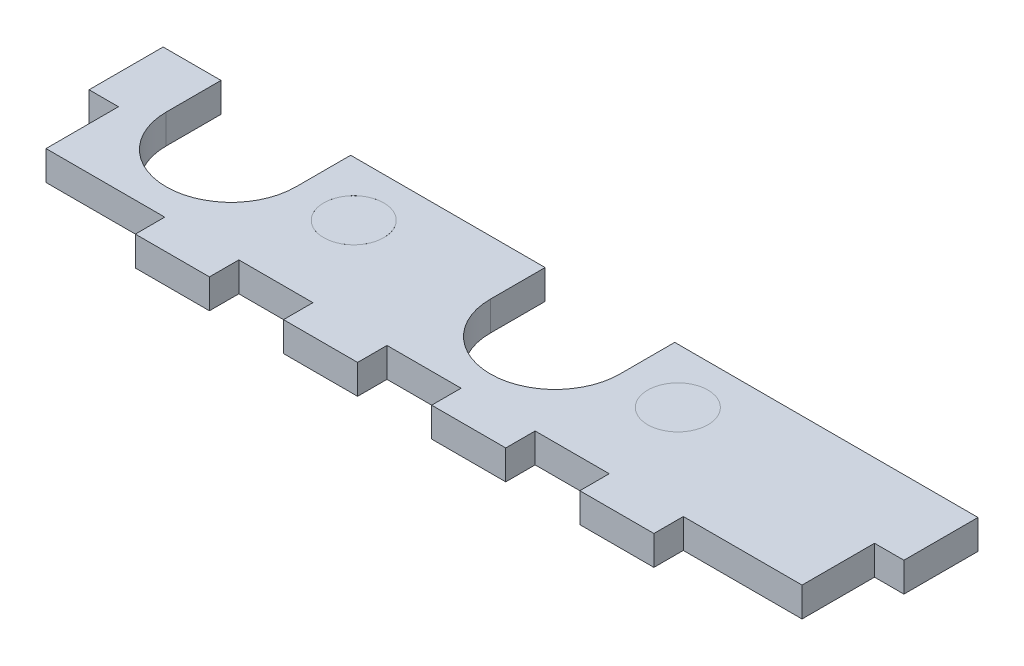
ISO-10303-21;
HEADER;
FILE_DESCRIPTION(('STEP AP214'),'2;1');
FILE_NAME('part.step','',(''),(''),'','','');
FILE_SCHEMA(('AUTOMOTIVE_DESIGN { 1 0 10303 214 1 1 1 1 }'));
ENDSEC;
DATA;
#1=APPLICATION_CONTEXT('core data for automotive mechanical design processes');
#2=APPLICATION_PROTOCOL_DEFINITION('international standard','automotive_design',2000,#1);
#3=PRODUCT_CONTEXT('',#1,'mechanical');
#4=PRODUCT('Part','Part','',(#3));
#5=PRODUCT_RELATED_PRODUCT_CATEGORY('part','',(#4));
#6=PRODUCT_DEFINITION_FORMATION('','',#4);
#7=PRODUCT_DEFINITION_CONTEXT('part definition',#1,'design');
#8=PRODUCT_DEFINITION('design','',#6,#7);
#9=PRODUCT_DEFINITION_SHAPE('','',#8);
#10=(LENGTH_UNIT() NAMED_UNIT(*) SI_UNIT(.MILLI.,.METRE.));
#11=(NAMED_UNIT(*) PLANE_ANGLE_UNIT() SI_UNIT($,.RADIAN.));
#12=(NAMED_UNIT(*) SI_UNIT($,.STERADIAN.) SOLID_ANGLE_UNIT());
#13=UNCERTAINTY_MEASURE_WITH_UNIT(LENGTH_MEASURE(1.E-05),#10,'distance_accuracy_value','');
#14=(GEOMETRIC_REPRESENTATION_CONTEXT(3) GLOBAL_UNCERTAINTY_ASSIGNED_CONTEXT((#13)) GLOBAL_UNIT_ASSIGNED_CONTEXT((#10,
#11,#12)) REPRESENTATION_CONTEXT('',''));
#15=CARTESIAN_POINT('',(0.,0.,0.));
#16=DIRECTION('',(0.,0.,1.));
#17=DIRECTION('',(1.,0.,0.));
#18=AXIS2_PLACEMENT_3D('',#15,#16,#17);
#19=CARTESIAN_POINT('',(61.5,0.,16.915));
#20=DIRECTION('',(0.,1.,0.));
#21=DIRECTION('',(0.,0.,1.));
#22=AXIS2_PLACEMENT_3D('',#19,#20,#21);
#23=CYLINDRICAL_SURFACE('',#22,3.24999999999999);
#24=CARTESIAN_POINT('',(61.5,0.,16.915));
#25=DIRECTION('',(0.,1.,0.));
#26=DIRECTION('',(0.,0.,1.));
#27=AXIS2_PLACEMENT_3D('',#24,#25,#26);
#28=CIRCLE('',#27,3.24999999999999);
#29=CARTESIAN_POINT('',(61.5,0.,20.165));
#30=VERTEX_POINT('',#29);
#31=EDGE_CURVE('E12',#30,#30,#28,.T.);
#32=ORIENTED_EDGE('',*,*,#31,.T.);
#33=EDGE_LOOP('',(#32));
#34=FACE_BOUND('',#33,.T.);
#35=CARTESIAN_POINT('',(61.5,3.175,16.915));
#36=DIRECTION('',(0.,1.,0.));
#37=DIRECTION('',(0.,0.,1.));
#38=AXIS2_PLACEMENT_3D('',#35,#36,#37);
#39=CIRCLE('',#38,3.24999999999999);
#40=CARTESIAN_POINT('',(61.5,3.175,20.165));
#41=VERTEX_POINT('',#40);
#42=EDGE_CURVE('E73',#41,#41,#39,.T.);
#43=ORIENTED_EDGE('',*,*,#42,.F.);
#44=EDGE_LOOP('',(#43));
#45=FACE_BOUND('',#44,.T.);
#46=ADVANCED_FACE('F70',(#34,#45),#23,.T.);
#47=CARTESIAN_POINT('',(61.5,0.,16.915));
#48=DIRECTION('',(0.,1.,0.));
#49=DIRECTION('',(0.,0.,1.));
#50=AXIS2_PLACEMENT_3D('',#47,#48,#49);
#51=PLANE('',#50);
#52=ORIENTED_EDGE('',*,*,#31,.F.);
#53=EDGE_LOOP('',(#52));
#54=FACE_BOUND('',#53,.T.);
#55=ADVANCED_FACE('F85',(#54),#51,.F.);
#56=CARTESIAN_POINT('',(61.5,3.175,16.915));
#57=DIRECTION('',(0.,1.,0.));
#58=DIRECTION('',(0.,0.,1.));
#59=AXIS2_PLACEMENT_3D('',#56,#57,#58);
#60=PLANE('',#59);
#61=ORIENTED_EDGE('',*,*,#42,.T.);
#62=EDGE_LOOP('',(#61));
#63=FACE_BOUND('',#62,.T.);
#64=ADVANCED_FACE('F82',(#63),#60,.T.);
#65=CLOSED_SHELL('',(#46,#55,#64));
#66=MANIFOLD_SOLID_BREP('B2',#65);
#67=CARTESIAN_POINT('',(26.5,0.,16.915));
#68=DIRECTION('',(0.,1.,0.));
#69=DIRECTION('',(0.,0.,1.));
#70=AXIS2_PLACEMENT_3D('',#67,#68,#69);
#71=CYLINDRICAL_SURFACE('',#70,3.24999999999999);
#72=CARTESIAN_POINT('',(26.5,0.,16.915));
#73=DIRECTION('',(0.,1.,0.));
#74=DIRECTION('',(0.,0.,1.));
#75=AXIS2_PLACEMENT_3D('',#72,#73,#74);
#76=CIRCLE('',#75,3.24999999999999);
#77=CARTESIAN_POINT('',(26.5,0.,20.165));
#78=VERTEX_POINT('',#77);
#79=EDGE_CURVE('E69',#78,#78,#76,.T.);
#80=ORIENTED_EDGE('',*,*,#79,.T.);
#81=EDGE_LOOP('',(#80));
#82=FACE_BOUND('',#81,.T.);
#83=CARTESIAN_POINT('',(26.5,3.175,16.915));
#84=DIRECTION('',(0.,1.,0.));
#85=DIRECTION('',(0.,0.,1.));
#86=AXIS2_PLACEMENT_3D('',#83,#84,#85);
#87=CIRCLE('',#86,3.24999999999999);
#88=CARTESIAN_POINT('',(26.5,3.175,20.165));
#89=VERTEX_POINT('',#88);
#90=EDGE_CURVE('E123',#89,#89,#87,.T.);
#91=ORIENTED_EDGE('',*,*,#90,.F.);
#92=EDGE_LOOP('',(#91));
#93=FACE_BOUND('',#92,.T.);
#94=ADVANCED_FACE('F120',(#82,#93),#71,.T.);
#95=CARTESIAN_POINT('',(26.5,0.,16.915));
#96=DIRECTION('',(0.,1.,0.));
#97=DIRECTION('',(0.,0.,1.));
#98=AXIS2_PLACEMENT_3D('',#95,#96,#97);
#99=PLANE('',#98);
#100=ORIENTED_EDGE('',*,*,#79,.F.);
#101=EDGE_LOOP('',(#100));
#102=FACE_BOUND('',#101,.T.);
#103=ADVANCED_FACE('F135',(#102),#99,.F.);
#104=CARTESIAN_POINT('',(26.5,3.175,16.915));
#105=DIRECTION('',(0.,1.,0.));
#106=DIRECTION('',(0.,0.,1.));
#107=AXIS2_PLACEMENT_3D('',#104,#105,#106);
#108=PLANE('',#107);
#109=ORIENTED_EDGE('',*,*,#90,.T.);
#110=EDGE_LOOP('',(#109));
#111=FACE_BOUND('',#110,.T.);
#112=ADVANCED_FACE('F132',(#111),#108,.T.);
#113=CLOSED_SHELL('',(#94,#103,#112));
#114=MANIFOLD_SOLID_BREP('B7',#113);
#115=CARTESIAN_POINT('',(0.,-0.00100000000000013,11.));
#116=DIRECTION('',(0.,0.,-1.));
#117=DIRECTION('',(-1.,0.,0.));
#118=AXIS2_PLACEMENT_3D('',#115,#116,#117);
#119=PLANE('',#118);
#120=DIRECTION('',(0.,1.,0.));
#121=VECTOR('',#120,1.);
#122=CARTESIAN_POINT('',(41.25,-0.00100000000000013,10.9999999999995));
#123=LINE('',#122,#121);
#124=CARTESIAN_POINT('',(41.25,0.,10.9999999999995));
#125=VERTEX_POINT('',#124);
#126=CARTESIAN_POINT('',(41.25,3.175,10.9999999999995));
#127=VERTEX_POINT('',#126);
#128=EDGE_CURVE('E404',#125,#127,#123,.T.);
#129=ORIENTED_EDGE('',*,*,#128,.F.);
#130=DIRECTION('',(1.,0.,0.));
#131=VECTOR('',#130,1.);
#132=CARTESIAN_POINT('',(0.,0.,11.));
#133=LINE('',#132,#131);
#134=CARTESIAN_POINT('',(20.25,0.,11.));
#135=VERTEX_POINT('',#134);
#136=EDGE_CURVE('E491',#135,#125,#133,.T.);
#137=ORIENTED_EDGE('',*,*,#136,.F.);
#138=DIRECTION('',(0.,1.,0.));
#139=VECTOR('',#138,1.);
#140=CARTESIAN_POINT('',(20.25,-0.00100000000000013,11.));
#141=LINE('',#140,#139);
#142=CARTESIAN_POINT('',(20.25,3.175,11.));
#143=VERTEX_POINT('',#142);
#144=EDGE_CURVE('E425',#135,#143,#141,.T.);
#145=ORIENTED_EDGE('',*,*,#144,.T.);
#146=DIRECTION('',(-1.,0.,0.));
#147=VECTOR('',#146,1.);
#148=CARTESIAN_POINT('',(0.,3.175,11.));
#149=LINE('',#148,#147);
#150=EDGE_CURVE('E186',#127,#143,#149,.T.);
#151=ORIENTED_EDGE('',*,*,#150,.F.);
#152=EDGE_LOOP('',(#129,#137,#145,#151));
#153=FACE_BOUND('',#152,.T.);
#154=ADVANCED_FACE('F161',(#153),#119,.T.);
#155=DIRECTION('',(0.,1.,0.));
#156=VECTOR('',#155,1.);
#157=CARTESIAN_POINT('',(6.25,-0.00100000000000013,11.));
#158=LINE('',#157,#156);
#159=CARTESIAN_POINT('',(6.25,0.,11.));
#160=VERTEX_POINT('',#159);
#161=CARTESIAN_POINT('',(6.25,3.175,11.));
#162=VERTEX_POINT('',#161);
#163=EDGE_CURVE('E423',#160,#162,#158,.T.);
#164=ORIENTED_EDGE('',*,*,#163,.F.);
#165=CARTESIAN_POINT('',(0.,0.,11.));
#166=VERTEX_POINT('',#165);
#167=EDGE_CURVE('E487',#166,#160,#133,.T.);
#168=ORIENTED_EDGE('',*,*,#167,.F.);
#169=DIRECTION('',(0.,1.,0.));
#170=VECTOR('',#169,1.);
#171=CARTESIAN_POINT('',(0.,-0.00100000000000013,11.));
#172=LINE('',#171,#170);
#173=CARTESIAN_POINT('',(0.,3.175,11.));
#174=VERTEX_POINT('',#173);
#175=EDGE_CURVE('E444',#166,#174,#172,.T.);
#176=ORIENTED_EDGE('',*,*,#175,.T.);
#177=EDGE_CURVE('E482',#162,#174,#149,.T.);
#178=ORIENTED_EDGE('',*,*,#177,.F.);
#179=EDGE_LOOP('',(#164,#168,#176,#178));
#180=FACE_BOUND('',#179,.T.);
#181=ADVANCED_FACE('F680',(#180),#119,.T.);
#182=CARTESIAN_POINT('',(0.,3.175,30.));
#183=DIRECTION('',(0.,0.,-1.));
#184=DIRECTION('',(-1.,0.,0.));
#185=AXIS2_PLACEMENT_3D('',#182,#183,#184);
#186=PLANE('',#185);
#187=DIRECTION('',(0.,1.,0.));
#188=VECTOR('',#187,1.);
#189=CARTESIAN_POINT('',(72.,-0.00100000000000013,30.));
#190=LINE('',#189,#188);
#191=CARTESIAN_POINT('',(72.,0.,30.));
#192=VERTEX_POINT('',#191);
#193=CARTESIAN_POINT('',(72.,3.175,30.));
#194=VERTEX_POINT('',#193);
#195=EDGE_CURVE('E450',#192,#194,#190,.T.);
#196=ORIENTED_EDGE('',*,*,#195,.T.);
#197=DIRECTION('',(1.,0.,0.));
#198=VECTOR('',#197,1.);
#199=CARTESIAN_POINT('',(0.,3.175,30.));
#200=LINE('',#199,#198);
#201=CARTESIAN_POINT('',(64.,3.175,30.));
#202=VERTEX_POINT('',#201);
#203=EDGE_CURVE('E605',#202,#194,#200,.T.);
#204=ORIENTED_EDGE('',*,*,#203,.F.);
#205=DIRECTION('',(0.,1.,0.));
#206=VECTOR('',#205,1.);
#207=CARTESIAN_POINT('',(64.,-0.00100000000000013,30.));
#208=LINE('',#207,#206);
#209=CARTESIAN_POINT('',(64.,0.,30.));
#210=VERTEX_POINT('',#209);
#211=EDGE_CURVE('E547',#210,#202,#208,.T.);
#212=ORIENTED_EDGE('',*,*,#211,.F.);
#213=DIRECTION('',(1.,0.,0.));
#214=VECTOR('',#213,1.);
#215=CARTESIAN_POINT('',(0.,0.,30.));
#216=LINE('',#215,#214);
#217=EDGE_CURVE('E609',#210,#192,#216,.T.);
#218=ORIENTED_EDGE('',*,*,#217,.T.);
#219=EDGE_LOOP('',(#196,#204,#212,#218));
#220=FACE_BOUND('',#219,.T.);
#221=ADVANCED_FACE('F645',(#220),#186,.F.);
#222=DIRECTION('',(0.,1.,0.));
#223=VECTOR('',#222,1.);
#224=CARTESIAN_POINT('',(56.,-0.00100000000000013,30.));
#225=LINE('',#224,#223);
#226=CARTESIAN_POINT('',(56.,0.,30.));
#227=VERTEX_POINT('',#226);
#228=CARTESIAN_POINT('',(56.,3.175,30.));
#229=VERTEX_POINT('',#228);
#230=EDGE_CURVE('E546',#227,#229,#225,.T.);
#231=ORIENTED_EDGE('',*,*,#230,.T.);
#232=CARTESIAN_POINT('',(48.,3.175,30.));
#233=VERTEX_POINT('',#232);
#234=EDGE_CURVE('E640',#233,#229,#200,.T.);
#235=ORIENTED_EDGE('',*,*,#234,.F.);
#236=DIRECTION('',(0.,1.,0.));
#237=VECTOR('',#236,1.);
#238=CARTESIAN_POINT('',(48.,-0.00100000000000013,30.));
#239=LINE('',#238,#237);
#240=CARTESIAN_POINT('',(48.,0.,30.));
#241=VERTEX_POINT('',#240);
#242=EDGE_CURVE('E523',#241,#233,#239,.T.);
#243=ORIENTED_EDGE('',*,*,#242,.F.);
#244=EDGE_CURVE('E618',#241,#227,#216,.T.);
#245=ORIENTED_EDGE('',*,*,#244,.T.);
#246=EDGE_LOOP('',(#231,#235,#243,#245));
#247=FACE_BOUND('',#246,.T.);
#248=ADVANCED_FACE('F627',(#247),#186,.F.);
#249=DIRECTION('',(0.,1.,0.));
#250=VECTOR('',#249,1.);
#251=CARTESIAN_POINT('',(40.,-0.00100000000000013,30.));
#252=LINE('',#251,#250);
#253=CARTESIAN_POINT('',(40.,0.,30.));
#254=VERTEX_POINT('',#253);
#255=CARTESIAN_POINT('',(40.,3.175,30.));
#256=VERTEX_POINT('',#255);
#257=EDGE_CURVE('E519',#254,#256,#252,.T.);
#258=ORIENTED_EDGE('',*,*,#257,.T.);
#259=CARTESIAN_POINT('',(32.,3.175,30.));
#260=VERTEX_POINT('',#259);
#261=EDGE_CURVE('E607',#260,#256,#200,.T.);
#262=ORIENTED_EDGE('',*,*,#261,.F.);
#263=DIRECTION('',(0.,1.,0.));
#264=VECTOR('',#263,1.);
#265=CARTESIAN_POINT('',(32.,-0.00100000000000013,30.));
#266=LINE('',#265,#264);
#267=CARTESIAN_POINT('',(32.,0.,30.));
#268=VERTEX_POINT('',#267);
#269=EDGE_CURVE('E496',#268,#260,#266,.T.);
#270=ORIENTED_EDGE('',*,*,#269,.F.);
#271=EDGE_CURVE('E612',#268,#254,#216,.T.);
#272=ORIENTED_EDGE('',*,*,#271,.T.);
#273=EDGE_LOOP('',(#258,#262,#270,#272));
#274=FACE_BOUND('',#273,.T.);
#275=ADVANCED_FACE('F716',(#274),#186,.F.);
#276=DIRECTION('',(0.,1.,0.));
#277=VECTOR('',#276,1.);
#278=CARTESIAN_POINT('',(24.,-0.00100000000000013,30.));
#279=LINE('',#278,#277);
#280=CARTESIAN_POINT('',(24.,0.,30.));
#281=VERTEX_POINT('',#280);
#282=CARTESIAN_POINT('',(24.,3.175,30.));
#283=VERTEX_POINT('',#282);
#284=EDGE_CURVE('E494',#281,#283,#279,.T.);
#285=ORIENTED_EDGE('',*,*,#284,.T.);
#286=CARTESIAN_POINT('',(16.,3.175,30.));
#287=VERTEX_POINT('',#286);
#288=EDGE_CURVE('E170',#287,#283,#200,.T.);
#289=ORIENTED_EDGE('',*,*,#288,.F.);
#290=DIRECTION('',(0.,1.,0.));
#291=VECTOR('',#290,1.);
#292=CARTESIAN_POINT('',(16.,-0.00100000000000013,30.));
#293=LINE('',#292,#291);
#294=CARTESIAN_POINT('',(16.,0.,30.));
#295=VERTEX_POINT('',#294);
#296=EDGE_CURVE('E594',#295,#287,#293,.T.);
#297=ORIENTED_EDGE('',*,*,#296,.F.);
#298=EDGE_CURVE('E610',#295,#281,#216,.T.);
#299=ORIENTED_EDGE('',*,*,#298,.T.);
#300=EDGE_LOOP('',(#285,#289,#297,#299));
#301=FACE_BOUND('',#300,.T.);
#302=ADVANCED_FACE('F699',(#301),#186,.F.);
#303=CARTESIAN_POINT('',(88.,3.175,0.));
#304=DIRECTION('',(-1.,0.,0.));
#305=DIRECTION('',(0.,0.,1.));
#306=AXIS2_PLACEMENT_3D('',#303,#304,#305);
#307=PLANE('',#306);
#308=DIRECTION('',(0.,1.,0.));
#309=VECTOR('',#308,1.);
#310=CARTESIAN_POINT('',(88.,-0.00100000000000013,11.));
#311=LINE('',#310,#309);
#312=CARTESIAN_POINT('',(88.,0.,11.));
#313=VERTEX_POINT('',#312);
#314=CARTESIAN_POINT('',(88.,3.175,11.));
#315=VERTEX_POINT('',#314);
#316=EDGE_CURVE('E447',#313,#315,#311,.T.);
#317=ORIENTED_EDGE('',*,*,#316,.T.);
#318=DIRECTION('',(0.,0.,-1.));
#319=VECTOR('',#318,1.);
#320=CARTESIAN_POINT('',(88.,3.175,0.));
#321=LINE('',#320,#319);
#322=CARTESIAN_POINT('',(88.,3.175,19.));
#323=VERTEX_POINT('',#322);
#324=EDGE_CURVE('E118',#323,#315,#321,.T.);
#325=ORIENTED_EDGE('',*,*,#324,.F.);
#326=DIRECTION('',(0.,1.,0.));
#327=VECTOR('',#326,1.);
#328=CARTESIAN_POINT('',(88.,-0.00100000000000013,19.));
#329=LINE('',#328,#327);
#330=CARTESIAN_POINT('',(88.,0.,19.));
#331=VERTEX_POINT('',#330);
#332=EDGE_CURVE('E451',#331,#323,#329,.T.);
#333=ORIENTED_EDGE('',*,*,#332,.F.);
#334=DIRECTION('',(0.,0.,-1.));
#335=VECTOR('',#334,1.);
#336=CARTESIAN_POINT('',(88.,0.,0.));
#337=LINE('',#336,#335);
#338=EDGE_CURVE('E165',#331,#313,#337,.T.);
#339=ORIENTED_EDGE('',*,*,#338,.T.);
#340=EDGE_LOOP('',(#317,#325,#333,#339));
#341=FACE_BOUND('',#340,.T.);
#342=ADVANCED_FACE('F663',(#341),#307,.F.);
#343=CARTESIAN_POINT('',(0.,3.175,0.));
#344=DIRECTION('',(0.,1.,0.));
#345=DIRECTION('',(0.,0.,1.));
#346=AXIS2_PLACEMENT_3D('',#343,#344,#345);
#347=PLANE('',#346);
#348=DIRECTION('',(0.,0.,1.));
#349=VECTOR('',#348,1.);
#350=CARTESIAN_POINT('',(41.25,3.175,16.9149999999995));
#351=LINE('',#350,#349);
#352=CARTESIAN_POINT('',(41.25,3.175,16.9149999999995));
#353=VERTEX_POINT('',#352);
#354=EDGE_CURVE('E383',#127,#353,#351,.T.);
#355=ORIENTED_EDGE('',*,*,#354,.F.);
#356=ORIENTED_EDGE('',*,*,#150,.T.);
#357=DIRECTION('',(0.,0.,-1.));
#358=VECTOR('',#357,1.);
#359=CARTESIAN_POINT('',(20.25,3.175,16.915));
#360=LINE('',#359,#358);
#361=CARTESIAN_POINT('',(20.25,3.175,16.915));
#362=VERTEX_POINT('',#361);
#363=EDGE_CURVE('E414',#362,#143,#360,.T.);
#364=ORIENTED_EDGE('',*,*,#363,.F.);
#365=CARTESIAN_POINT('',(13.25,3.175,16.915));
#366=DIRECTION('',(0.,1.,0.));
#367=DIRECTION('',(0.,0.,1.));
#368=AXIS2_PLACEMENT_3D('',#365,#366,#367);
#369=CIRCLE('',#368,7.);
#370=CARTESIAN_POINT('',(6.25,3.175,16.915));
#371=VERTEX_POINT('',#370);
#372=EDGE_CURVE('E411',#371,#362,#369,.T.);
#373=ORIENTED_EDGE('',*,*,#372,.F.);
#374=DIRECTION('',(0.,0.,1.));
#375=VECTOR('',#374,1.);
#376=CARTESIAN_POINT('',(6.25,3.175,16.915));
#377=LINE('',#376,#375);
#378=EDGE_CURVE('E416',#162,#371,#377,.T.);
#379=ORIENTED_EDGE('',*,*,#378,.F.);
#380=ORIENTED_EDGE('',*,*,#177,.T.);
#381=DIRECTION('',(0.,0.,1.));
#382=VECTOR('',#381,1.);
#383=CARTESIAN_POINT('',(0.,3.175,0.));
#384=LINE('',#383,#382);
#385=CARTESIAN_POINT('',(0.,3.175,19.));
#386=VERTEX_POINT('',#385);
#387=EDGE_CURVE('E603',#174,#386,#384,.T.);
#388=ORIENTED_EDGE('',*,*,#387,.T.);
#389=DIRECTION('',(1.,0.,0.));
#390=VECTOR('',#389,1.);
#391=CARTESIAN_POINT('',(0.,3.175,19.));
#392=LINE('',#391,#390);
#393=CARTESIAN_POINT('',(3.175,3.175,19.));
#394=VERTEX_POINT('',#393);
#395=EDGE_CURVE('E579',#386,#394,#392,.T.);
#396=ORIENTED_EDGE('',*,*,#395,.T.);
#397=DIRECTION('',(0.,0.,1.));
#398=VECTOR('',#397,1.);
#399=CARTESIAN_POINT('',(3.175,3.175,0.));
#400=LINE('',#399,#398);
#401=CARTESIAN_POINT('',(3.175,3.175,26.825));
#402=VERTEX_POINT('',#401);
#403=EDGE_CURVE('E576',#394,#402,#400,.T.);
#404=ORIENTED_EDGE('',*,*,#403,.T.);
#405=DIRECTION('',(1.,0.,0.));
#406=VECTOR('',#405,1.);
#407=CARTESIAN_POINT('',(0.,3.175,26.825));
#408=LINE('',#407,#406);
#409=CARTESIAN_POINT('',(16.,3.175,26.825));
#410=VERTEX_POINT('',#409);
#411=EDGE_CURVE('E585',#402,#410,#408,.T.);
#412=ORIENTED_EDGE('',*,*,#411,.T.);
#413=DIRECTION('',(0.,0.,-1.));
#414=VECTOR('',#413,1.);
#415=CARTESIAN_POINT('',(16.,3.175,0.));
#416=LINE('',#415,#414);
#417=EDGE_CURVE('E582',#287,#410,#416,.T.);
#418=ORIENTED_EDGE('',*,*,#417,.F.);
#419=ORIENTED_EDGE('',*,*,#288,.T.);
#420=DIRECTION('',(0.,0.,-1.));
#421=VECTOR('',#420,1.);
#422=CARTESIAN_POINT('',(24.,3.175,0.));
#423=LINE('',#422,#421);
#424=CARTESIAN_POINT('',(24.,3.175,26.825));
#425=VERTEX_POINT('',#424);
#426=EDGE_CURVE('E498',#283,#425,#423,.T.);
#427=ORIENTED_EDGE('',*,*,#426,.T.);
#428=DIRECTION('',(-1.,0.,0.));
#429=VECTOR('',#428,1.);
#430=CARTESIAN_POINT('',(0.,3.175,26.825));
#431=LINE('',#430,#429);
#432=CARTESIAN_POINT('',(32.,3.175,26.825));
#433=VERTEX_POINT('',#432);
#434=EDGE_CURVE('E507',#433,#425,#431,.T.);
#435=ORIENTED_EDGE('',*,*,#434,.F.);
#436=DIRECTION('',(0.,0.,-1.));
#437=VECTOR('',#436,1.);
#438=CARTESIAN_POINT('',(32.,3.175,0.));
#439=LINE('',#438,#437);
#440=EDGE_CURVE('E510',#260,#433,#439,.T.);
#441=ORIENTED_EDGE('',*,*,#440,.F.);
#442=ORIENTED_EDGE('',*,*,#261,.T.);
#443=DIRECTION('',(0.,0.,-1.));
#444=VECTOR('',#443,1.);
#445=CARTESIAN_POINT('',(40.,3.175,0.));
#446=LINE('',#445,#444);
#447=CARTESIAN_POINT('',(40.,3.175,26.825));
#448=VERTEX_POINT('',#447);
#449=EDGE_CURVE('E535',#256,#448,#446,.T.);
#450=ORIENTED_EDGE('',*,*,#449,.T.);
#451=DIRECTION('',(1.,0.,0.));
#452=VECTOR('',#451,1.);
#453=CARTESIAN_POINT('',(0.,3.175,26.825));
#454=LINE('',#453,#452);
#455=CARTESIAN_POINT('',(48.,3.175,26.825));
#456=VERTEX_POINT('',#455);
#457=EDGE_CURVE('E522',#448,#456,#454,.T.);
#458=ORIENTED_EDGE('',*,*,#457,.T.);
#459=DIRECTION('',(0.,0.,-1.));
#460=VECTOR('',#459,1.);
#461=CARTESIAN_POINT('',(48.,3.175,0.));
#462=LINE('',#461,#460);
#463=EDGE_CURVE('E532',#233,#456,#462,.T.);
#464=ORIENTED_EDGE('',*,*,#463,.F.);
#465=ORIENTED_EDGE('',*,*,#234,.T.);
#466=DIRECTION('',(0.,0.,-1.));
#467=VECTOR('',#466,1.);
#468=CARTESIAN_POINT('',(56.,3.175,0.));
#469=LINE('',#468,#467);
#470=CARTESIAN_POINT('',(56.,3.175,26.825));
#471=VERTEX_POINT('',#470);
#472=EDGE_CURVE('E549',#229,#471,#469,.T.);
#473=ORIENTED_EDGE('',*,*,#472,.T.);
#474=DIRECTION('',(1.,0.,0.));
#475=VECTOR('',#474,1.);
#476=CARTESIAN_POINT('',(0.,3.175,26.825));
#477=LINE('',#476,#475);
#478=CARTESIAN_POINT('',(64.,3.175,26.825));
#479=VERTEX_POINT('',#478);
#480=EDGE_CURVE('E558',#471,#479,#477,.T.);
#481=ORIENTED_EDGE('',*,*,#480,.T.);
#482=DIRECTION('',(0.,0.,-1.));
#483=VECTOR('',#482,1.);
#484=CARTESIAN_POINT('',(64.,3.175,0.));
#485=LINE('',#484,#483);
#486=EDGE_CURVE('E561',#202,#479,#485,.T.);
#487=ORIENTED_EDGE('',*,*,#486,.F.);
#488=ORIENTED_EDGE('',*,*,#203,.T.);
#489=DIRECTION('',(0.,0.,-1.));
#490=VECTOR('',#489,1.);
#491=CARTESIAN_POINT('',(72.,3.175,0.));
#492=LINE('',#491,#490);
#493=CARTESIAN_POINT('',(72.,3.175,26.825));
#494=VERTEX_POINT('',#493);
#495=EDGE_CURVE('E453',#194,#494,#492,.T.);
#496=ORIENTED_EDGE('',*,*,#495,.T.);
#497=DIRECTION('',(-1.,0.,0.));
#498=VECTOR('',#497,1.);
#499=CARTESIAN_POINT('',(0.,3.175,26.825));
#500=LINE('',#499,#498);
#501=CARTESIAN_POINT('',(84.825,3.175,26.825));
#502=VERTEX_POINT('',#501);
#503=EDGE_CURVE('E464',#502,#494,#500,.T.);
#504=ORIENTED_EDGE('',*,*,#503,.F.);
#505=DIRECTION('',(0.,0.,1.));
#506=VECTOR('',#505,1.);
#507=CARTESIAN_POINT('',(84.825,3.175,0.));
#508=LINE('',#507,#506);
#509=CARTESIAN_POINT('',(84.825,3.175,19.));
#510=VERTEX_POINT('',#509);
#511=EDGE_CURVE('E467',#510,#502,#508,.T.);
#512=ORIENTED_EDGE('',*,*,#511,.F.);
#513=DIRECTION('',(-1.,0.,0.));
#514=VECTOR('',#513,1.);
#515=CARTESIAN_POINT('',(0.,3.175,19.));
#516=LINE('',#515,#514);
#517=EDGE_CURVE('E470',#323,#510,#516,.T.);
#518=ORIENTED_EDGE('',*,*,#517,.F.);
#519=ORIENTED_EDGE('',*,*,#324,.T.);
#520=CARTESIAN_POINT('',(55.25,3.175,11.));
#521=VERTEX_POINT('',#520);
#522=EDGE_CURVE('E483',#315,#521,#149,.T.);
#523=ORIENTED_EDGE('',*,*,#522,.T.);
#524=DIRECTION('',(0.,0.,-1.));
#525=VECTOR('',#524,1.);
#526=CARTESIAN_POINT('',(55.25,3.175,16.9149999999995));
#527=LINE('',#526,#525);
#528=CARTESIAN_POINT('',(55.25,3.175,16.9149999999995));
#529=VERTEX_POINT('',#528);
#530=EDGE_CURVE('E178',#529,#521,#527,.T.);
#531=ORIENTED_EDGE('',*,*,#530,.F.);
#532=CARTESIAN_POINT('',(48.25,3.175,16.9149999999995));
#533=DIRECTION('',(0.,1.,0.));
#534=DIRECTION('',(0.,0.,1.));
#535=AXIS2_PLACEMENT_3D('',#532,#533,#534);
#536=CIRCLE('',#535,7.);
#537=EDGE_CURVE('E381',#353,#529,#536,.T.);
#538=ORIENTED_EDGE('',*,*,#537,.F.);
#539=EDGE_LOOP('',(#355,#356,#364,#373,#379,#380,#388,#396,#404,#412,#418,#419,#427,#435,#441,
#442,#450,#458,#464,#465,#473,#481,#487,#488,#496,#504,#512,#518,#519,#523,#531,#538));
#540=FACE_BOUND('',#539,.T.);
#541=CARTESIAN_POINT('',(26.5,3.175,16.915));
#542=DIRECTION('',(0.,1.,0.));
#543=DIRECTION('',(0.,0.,-1.));
#544=AXIS2_PLACEMENT_3D('',#541,#542,#543);
#545=CIRCLE('',#544,3.24999999999999);
#546=CARTESIAN_POINT('',(26.5,3.175,13.665));
#547=VERTEX_POINT('',#546);
#548=EDGE_CURVE('E431',#547,#547,#545,.T.);
#549=ORIENTED_EDGE('',*,*,#548,.F.);
#550=EDGE_LOOP('',(#549));
#551=FACE_BOUND('',#550,.T.);
#552=CARTESIAN_POINT('',(61.5,3.175,16.915));
#553=DIRECTION('',(0.,1.,0.));
#554=DIRECTION('',(0.,0.,1.));
#555=AXIS2_PLACEMENT_3D('',#552,#553,#554);
#556=CIRCLE('',#555,3.24999999999999);
#557=CARTESIAN_POINT('',(61.5,3.175,20.165));
#558=VERTEX_POINT('',#557);
#559=EDGE_CURVE('E437',#558,#558,#556,.T.);
#560=ORIENTED_EDGE('',*,*,#559,.F.);
#561=EDGE_LOOP('',(#560));
#562=FACE_BOUND('',#561,.T.);
#563=ADVANCED_FACE('F636',(#540,#551,#562),#347,.T.);
#564=CARTESIAN_POINT('',(0.,0.,0.));
#565=DIRECTION('',(0.,1.,0.));
#566=DIRECTION('',(0.,0.,1.));
#567=AXIS2_PLACEMENT_3D('',#564,#565,#566);
#568=PLANE('',#567);
#569=CARTESIAN_POINT('',(26.5,0.,16.915));
#570=DIRECTION('',(0.,1.,0.));
#571=DIRECTION('',(0.,0.,1.));
#572=AXIS2_PLACEMENT_3D('',#569,#570,#571);
#573=CIRCLE('',#572,3.24999999999999);
#574=CARTESIAN_POINT('',(26.5,0.,20.165));
#575=VERTEX_POINT('',#574);
#576=EDGE_CURVE('E434',#575,#575,#573,.F.);
#577=ORIENTED_EDGE('',*,*,#576,.F.);
#578=EDGE_LOOP('',(#577));
#579=FACE_BOUND('',#578,.T.);
#580=CARTESIAN_POINT('',(61.5,0.,16.915));
#581=DIRECTION('',(0.,1.,0.));
#582=DIRECTION('',(0.,0.,1.));
#583=AXIS2_PLACEMENT_3D('',#580,#581,#582);
#584=CIRCLE('',#583,3.24999999999999);
#585=CARTESIAN_POINT('',(61.5,0.,20.165));
#586=VERTEX_POINT('',#585);
#587=EDGE_CURVE('E440',#586,#586,#584,.F.);
#588=ORIENTED_EDGE('',*,*,#587,.F.);
#589=EDGE_LOOP('',(#588));
#590=FACE_BOUND('',#589,.T.);
#591=ORIENTED_EDGE('',*,*,#136,.T.);
#592=DIRECTION('',(0.,0.,-1.));
#593=VECTOR('',#592,1.);
#594=CARTESIAN_POINT('',(41.25,0.,16.9149999999995));
#595=LINE('',#594,#593);
#596=CARTESIAN_POINT('',(41.25,0.,16.9149999999995));
#597=VERTEX_POINT('',#596);
#598=EDGE_CURVE('E395',#597,#125,#595,.T.);
#599=ORIENTED_EDGE('',*,*,#598,.F.);
#600=CARTESIAN_POINT('',(48.25,0.,16.9149999999995));
#601=DIRECTION('',(0.,1.,0.));
#602=DIRECTION('',(0.,0.,1.));
#603=AXIS2_PLACEMENT_3D('',#600,#601,#602);
#604=CIRCLE('',#603,7.);
#605=CARTESIAN_POINT('',(55.25,0.,16.9149999999995));
#606=VERTEX_POINT('',#605);
#607=EDGE_CURVE('E378',#606,#597,#604,.F.);
#608=ORIENTED_EDGE('',*,*,#607,.F.);
#609=DIRECTION('',(0.,0.,1.));
#610=VECTOR('',#609,1.);
#611=CARTESIAN_POINT('',(55.25,0.,16.9149999999995));
#612=LINE('',#611,#610);
#613=CARTESIAN_POINT('',(55.25,0.,10.9999999999995));
#614=VERTEX_POINT('',#613);
#615=EDGE_CURVE('E386',#614,#606,#612,.T.);
#616=ORIENTED_EDGE('',*,*,#615,.F.);
#617=EDGE_CURVE('E486',#614,#313,#133,.T.);
#618=ORIENTED_EDGE('',*,*,#617,.T.);
#619=ORIENTED_EDGE('',*,*,#338,.F.);
#620=DIRECTION('',(1.,0.,0.));
#621=VECTOR('',#620,1.);
#622=CARTESIAN_POINT('',(0.,0.,19.));
#623=LINE('',#622,#621);
#624=CARTESIAN_POINT('',(84.825,0.,19.));
#625=VERTEX_POINT('',#624);
#626=EDGE_CURVE('E443',#625,#331,#623,.T.);
#627=ORIENTED_EDGE('',*,*,#626,.F.);
#628=DIRECTION('',(0.,0.,-1.));
#629=VECTOR('',#628,1.);
#630=CARTESIAN_POINT('',(84.825,0.,0.));
#631=LINE('',#630,#629);
#632=CARTESIAN_POINT('',(84.825,0.,26.825));
#633=VERTEX_POINT('',#632);
#634=EDGE_CURVE('E448',#633,#625,#631,.T.);
#635=ORIENTED_EDGE('',*,*,#634,.F.);
#636=DIRECTION('',(1.,0.,0.));
#637=VECTOR('',#636,1.);
#638=CARTESIAN_POINT('',(0.,0.,26.825));
#639=LINE('',#638,#637);
#640=CARTESIAN_POINT('',(72.,0.,26.825));
#641=VERTEX_POINT('',#640);
#642=EDGE_CURVE('E476',#641,#633,#639,.T.);
#643=ORIENTED_EDGE('',*,*,#642,.F.);
#644=DIRECTION('',(0.,0.,1.));
#645=VECTOR('',#644,1.);
#646=CARTESIAN_POINT('',(72.,0.,0.));
#647=LINE('',#646,#645);
#648=EDGE_CURVE('E473',#641,#192,#647,.T.);
#649=ORIENTED_EDGE('',*,*,#648,.T.);
#650=ORIENTED_EDGE('',*,*,#217,.F.);
#651=DIRECTION('',(0.,0.,1.));
#652=VECTOR('',#651,1.);
#653=CARTESIAN_POINT('',(64.,0.,0.));
#654=LINE('',#653,#652);
#655=CARTESIAN_POINT('',(64.,0.,26.825));
#656=VERTEX_POINT('',#655);
#657=EDGE_CURVE('E490',#656,#210,#654,.T.);
#658=ORIENTED_EDGE('',*,*,#657,.F.);
#659=DIRECTION('',(-1.,0.,0.));
#660=VECTOR('',#659,1.);
#661=CARTESIAN_POINT('',(0.,0.,26.825));
#662=LINE('',#661,#660);
#663=CARTESIAN_POINT('',(56.,0.,26.825));
#664=VERTEX_POINT('',#663);
#665=EDGE_CURVE('E529',#656,#664,#662,.T.);
#666=ORIENTED_EDGE('',*,*,#665,.T.);
#667=DIRECTION('',(0.,0.,1.));
#668=VECTOR('',#667,1.);
#669=CARTESIAN_POINT('',(56.,0.,0.));
#670=LINE('',#669,#668);
#671=EDGE_CURVE('E564',#664,#227,#670,.T.);
#672=ORIENTED_EDGE('',*,*,#671,.T.);
#673=ORIENTED_EDGE('',*,*,#244,.F.);
#674=DIRECTION('',(0.,0.,1.));
#675=VECTOR('',#674,1.);
#676=CARTESIAN_POINT('',(48.,0.,0.));
#677=LINE('',#676,#675);
#678=CARTESIAN_POINT('',(48.,0.,26.825));
#679=VERTEX_POINT('',#678);
#680=EDGE_CURVE('E495',#679,#241,#677,.T.);
#681=ORIENTED_EDGE('',*,*,#680,.F.);
#682=DIRECTION('',(-1.,0.,0.));
#683=VECTOR('',#682,1.);
#684=CARTESIAN_POINT('',(0.,0.,26.825));
#685=LINE('',#684,#683);
#686=CARTESIAN_POINT('',(40.,0.,26.825));
#687=VERTEX_POINT('',#686);
#688=EDGE_CURVE('E541',#679,#687,#685,.T.);
#689=ORIENTED_EDGE('',*,*,#688,.T.);
#690=DIRECTION('',(0.,0.,1.));
#691=VECTOR('',#690,1.);
#692=CARTESIAN_POINT('',(40.,0.,0.));
#693=LINE('',#692,#691);
#694=EDGE_CURVE('E538',#687,#254,#693,.T.);
#695=ORIENTED_EDGE('',*,*,#694,.T.);
#696=ORIENTED_EDGE('',*,*,#271,.F.);
#697=DIRECTION('',(0.,0.,1.));
#698=VECTOR('',#697,1.);
#699=CARTESIAN_POINT('',(32.,0.,0.));
#700=LINE('',#699,#698);
#701=CARTESIAN_POINT('',(32.,0.,26.825));
#702=VERTEX_POINT('',#701);
#703=EDGE_CURVE('E492',#702,#268,#700,.T.);
#704=ORIENTED_EDGE('',*,*,#703,.F.);
#705=DIRECTION('',(1.,0.,0.));
#706=VECTOR('',#705,1.);
#707=CARTESIAN_POINT('',(0.,0.,26.825));
#708=LINE('',#707,#706);
#709=CARTESIAN_POINT('',(24.,0.,26.825));
#710=VERTEX_POINT('',#709);
#711=EDGE_CURVE('E516',#710,#702,#708,.T.);
#712=ORIENTED_EDGE('',*,*,#711,.F.);
#713=DIRECTION('',(0.,0.,1.));
#714=VECTOR('',#713,1.);
#715=CARTESIAN_POINT('',(24.,0.,0.));
#716=LINE('',#715,#714);
#717=EDGE_CURVE('E513',#710,#281,#716,.T.);
#718=ORIENTED_EDGE('',*,*,#717,.T.);
#719=ORIENTED_EDGE('',*,*,#298,.F.);
#720=DIRECTION('',(0.,0.,1.));
#721=VECTOR('',#720,1.);
#722=CARTESIAN_POINT('',(16.,0.,0.));
#723=LINE('',#722,#721);
#724=CARTESIAN_POINT('',(16.,0.,26.825));
#725=VERTEX_POINT('',#724);
#726=EDGE_CURVE('E574',#725,#295,#723,.T.);
#727=ORIENTED_EDGE('',*,*,#726,.F.);
#728=DIRECTION('',(-1.,0.,0.));
#729=VECTOR('',#728,1.);
#730=CARTESIAN_POINT('',(0.,0.,26.825));
#731=LINE('',#730,#729);
#732=CARTESIAN_POINT('',(3.175,0.,26.825));
#733=VERTEX_POINT('',#732);
#734=EDGE_CURVE('E571',#725,#733,#731,.T.);
#735=ORIENTED_EDGE('',*,*,#734,.T.);
#736=DIRECTION('',(0.,0.,-1.));
#737=VECTOR('',#736,1.);
#738=CARTESIAN_POINT('',(3.175,0.,0.));
#739=LINE('',#738,#737);
#740=CARTESIAN_POINT('',(3.175,0.,19.));
#741=VERTEX_POINT('',#740);
#742=EDGE_CURVE('E518',#733,#741,#739,.T.);
#743=ORIENTED_EDGE('',*,*,#742,.T.);
#744=DIRECTION('',(-1.,0.,0.));
#745=VECTOR('',#744,1.);
#746=CARTESIAN_POINT('',(0.,0.,19.));
#747=LINE('',#746,#745);
#748=CARTESIAN_POINT('',(0.,0.,19.));
#749=VERTEX_POINT('',#748);
#750=EDGE_CURVE('E591',#741,#749,#747,.T.);
#751=ORIENTED_EDGE('',*,*,#750,.T.);
#752=DIRECTION('',(0.,0.,1.));
#753=VECTOR('',#752,1.);
#754=CARTESIAN_POINT('',(0.,0.,0.));
#755=LINE('',#754,#753);
#756=EDGE_CURVE('E602',#166,#749,#755,.T.);
#757=ORIENTED_EDGE('',*,*,#756,.F.);
#758=ORIENTED_EDGE('',*,*,#167,.T.);
#759=DIRECTION('',(0.,0.,-1.));
#760=VECTOR('',#759,1.);
#761=CARTESIAN_POINT('',(6.25,0.,16.915));
#762=LINE('',#761,#760);
#763=CARTESIAN_POINT('',(6.25,0.,16.915));
#764=VERTEX_POINT('',#763);
#765=EDGE_CURVE('E409',#764,#160,#762,.T.);
#766=ORIENTED_EDGE('',*,*,#765,.F.);
#767=CARTESIAN_POINT('',(13.25,0.,16.915));
#768=DIRECTION('',(0.,1.,0.));
#769=DIRECTION('',(0.,0.,1.));
#770=AXIS2_PLACEMENT_3D('',#767,#768,#769);
#771=CIRCLE('',#770,7.);
#772=CARTESIAN_POINT('',(20.25,0.,16.915));
#773=VERTEX_POINT('',#772);
#774=EDGE_CURVE('E390',#773,#764,#771,.F.);
#775=ORIENTED_EDGE('',*,*,#774,.F.);
#776=DIRECTION('',(0.,0.,1.));
#777=VECTOR('',#776,1.);
#778=CARTESIAN_POINT('',(20.25,0.,16.915));
#779=LINE('',#778,#777);
#780=EDGE_CURVE('E422',#135,#773,#779,.T.);
#781=ORIENTED_EDGE('',*,*,#780,.F.);
#782=EDGE_LOOP('',(#591,#599,#608,#616,#618,#619,#627,#635,#643,#649,#650,#658,#666,#672,#673,
#681,#689,#695,#696,#704,#712,#718,#719,#727,#735,#743,#751,#757,#758,#766,#775,#781));
#783=FACE_BOUND('',#782,.T.);
#784=ADVANCED_FACE('F394',(#579,#590,#783),#568,.F.);
#785=CARTESIAN_POINT('',(0.,3.175,0.));
#786=DIRECTION('',(1.,0.,0.));
#787=DIRECTION('',(0.,0.,-1.));
#788=AXIS2_PLACEMENT_3D('',#785,#786,#787);
#789=PLANE('',#788);
#790=ORIENTED_EDGE('',*,*,#387,.F.);
#791=ORIENTED_EDGE('',*,*,#175,.F.);
#792=ORIENTED_EDGE('',*,*,#756,.T.);
#793=DIRECTION('',(0.,1.,0.));
#794=VECTOR('',#793,1.);
#795=CARTESIAN_POINT('',(0.,-0.00100000000000013,19.));
#796=LINE('',#795,#794);
#797=EDGE_CURVE('E596',#749,#386,#796,.T.);
#798=ORIENTED_EDGE('',*,*,#797,.T.);
#799=EDGE_LOOP('',(#790,#791,#792,#798));
#800=FACE_BOUND('',#799,.T.);
#801=ADVANCED_FACE('F163',(#800),#789,.F.);
#802=CARTESIAN_POINT('',(3.175,-0.00100000000000013,0.));
#803=DIRECTION('',(-1.,0.,0.));
#804=DIRECTION('',(0.,0.,1.));
#805=AXIS2_PLACEMENT_3D('',#802,#803,#804);
#806=PLANE('',#805);
#807=DIRECTION('',(0.,1.,0.));
#808=VECTOR('',#807,1.);
#809=CARTESIAN_POINT('',(3.175,-0.00100000000000013,26.825));
#810=LINE('',#809,#808);
#811=EDGE_CURVE('E589',#733,#402,#810,.T.);
#812=ORIENTED_EDGE('',*,*,#811,.T.);
#813=ORIENTED_EDGE('',*,*,#403,.F.);
#814=DIRECTION('',(0.,1.,0.));
#815=VECTOR('',#814,1.);
#816=CARTESIAN_POINT('',(3.175,-0.00100000000000013,19.));
#817=LINE('',#816,#815);
#818=EDGE_CURVE('E588',#741,#394,#817,.T.);
#819=ORIENTED_EDGE('',*,*,#818,.F.);
#820=ORIENTED_EDGE('',*,*,#742,.F.);
#821=EDGE_LOOP('',(#812,#813,#819,#820));
#822=FACE_BOUND('',#821,.T.);
#823=ADVANCED_FACE('F690',(#822),#806,.T.);
#824=CARTESIAN_POINT('',(0.,-0.00100000000000013,26.825));
#825=DIRECTION('',(0.,0.,1.));
#826=DIRECTION('',(1.,0.,0.));
#827=AXIS2_PLACEMENT_3D('',#824,#825,#826);
#828=PLANE('',#827);
#829=DIRECTION('',(0.,1.,0.));
#830=VECTOR('',#829,1.);
#831=CARTESIAN_POINT('',(16.,-0.00100000000000013,26.825));
#832=LINE('',#831,#830);
#833=EDGE_CURVE('E592',#725,#410,#832,.T.);
#834=ORIENTED_EDGE('',*,*,#833,.T.);
#835=ORIENTED_EDGE('',*,*,#411,.F.);
#836=ORIENTED_EDGE('',*,*,#811,.F.);
#837=ORIENTED_EDGE('',*,*,#734,.F.);
#838=EDGE_LOOP('',(#834,#835,#836,#837));
#839=FACE_BOUND('',#838,.T.);
#840=ADVANCED_FACE('F694',(#839),#828,.T.);
#841=CARTESIAN_POINT('',(16.,-0.00100000000000013,0.));
#842=DIRECTION('',(1.,0.,0.));
#843=DIRECTION('',(0.,0.,-1.));
#844=AXIS2_PLACEMENT_3D('',#841,#842,#843);
#845=PLANE('',#844);
#846=ORIENTED_EDGE('',*,*,#726,.T.);
#847=ORIENTED_EDGE('',*,*,#296,.T.);
#848=ORIENTED_EDGE('',*,*,#417,.T.);
#849=ORIENTED_EDGE('',*,*,#833,.F.);
#850=EDGE_LOOP('',(#846,#847,#848,#849));
#851=FACE_BOUND('',#850,.T.);
#852=ADVANCED_FACE('F974',(#851),#845,.F.);
#853=CARTESIAN_POINT('',(0.,-0.00100000000000013,19.));
#854=DIRECTION('',(0.,0.,1.));
#855=DIRECTION('',(1.,0.,0.));
#856=AXIS2_PLACEMENT_3D('',#853,#854,#855);
#857=PLANE('',#856);
#858=ORIENTED_EDGE('',*,*,#818,.T.);
#859=ORIENTED_EDGE('',*,*,#395,.F.);
#860=ORIENTED_EDGE('',*,*,#797,.F.);
#861=ORIENTED_EDGE('',*,*,#750,.F.);
#862=EDGE_LOOP('',(#858,#859,#860,#861));
#863=FACE_BOUND('',#862,.T.);
#864=ADVANCED_FACE('F685',(#863),#857,.T.);
#865=CARTESIAN_POINT('',(24.,-0.00100000000000013,0.));
#866=DIRECTION('',(1.,0.,0.));
#867=DIRECTION('',(0.,0.,-1.));
#868=AXIS2_PLACEMENT_3D('',#865,#866,#867);
#869=PLANE('',#868);
#870=DIRECTION('',(0.,1.,0.));
#871=VECTOR('',#870,1.);
#872=CARTESIAN_POINT('',(24.,-0.00100000000000013,26.825));
#873=LINE('',#872,#871);
#874=EDGE_CURVE('E501',#710,#425,#873,.T.);
#875=ORIENTED_EDGE('',*,*,#874,.T.);
#876=ORIENTED_EDGE('',*,*,#426,.F.);
#877=ORIENTED_EDGE('',*,*,#284,.F.);
#878=ORIENTED_EDGE('',*,*,#717,.F.);
#879=EDGE_LOOP('',(#875,#876,#877,#878));
#880=FACE_BOUND('',#879,.T.);
#881=ADVANCED_FACE('F702',(#880),#869,.T.);
#882=CARTESIAN_POINT('',(0.,-0.00100000000000013,26.825));
#883=DIRECTION('',(0.,0.,-1.));
#884=DIRECTION('',(-1.,0.,0.));
#885=AXIS2_PLACEMENT_3D('',#882,#883,#884);
#886=PLANE('',#885);
#887=ORIENTED_EDGE('',*,*,#711,.T.);
#888=DIRECTION('',(0.,1.,0.));
#889=VECTOR('',#888,1.);
#890=CARTESIAN_POINT('',(32.,-0.00100000000000013,26.825));
#891=LINE('',#890,#889);
#892=EDGE_CURVE('E499',#702,#433,#891,.T.);
#893=ORIENTED_EDGE('',*,*,#892,.T.);
#894=ORIENTED_EDGE('',*,*,#434,.T.);
#895=ORIENTED_EDGE('',*,*,#874,.F.);
#896=EDGE_LOOP('',(#887,#893,#894,#895));
#897=FACE_BOUND('',#896,.T.);
#898=ADVANCED_FACE('F708',(#897),#886,.F.);
#899=CARTESIAN_POINT('',(32.,-0.00100000000000013,0.));
#900=DIRECTION('',(1.,0.,0.));
#901=DIRECTION('',(0.,0.,-1.));
#902=AXIS2_PLACEMENT_3D('',#899,#900,#901);
#903=PLANE('',#902);
#904=ORIENTED_EDGE('',*,*,#703,.T.);
#905=ORIENTED_EDGE('',*,*,#269,.T.);
#906=ORIENTED_EDGE('',*,*,#440,.T.);
#907=ORIENTED_EDGE('',*,*,#892,.F.);
#908=EDGE_LOOP('',(#904,#905,#906,#907));
#909=FACE_BOUND('',#908,.T.);
#910=ADVANCED_FACE('F710',(#909),#903,.F.);
#911=CARTESIAN_POINT('',(40.,-0.00100000000000013,0.));
#912=DIRECTION('',(1.,0.,0.));
#913=DIRECTION('',(0.,0.,-1.));
#914=AXIS2_PLACEMENT_3D('',#911,#912,#913);
#915=PLANE('',#914);
#916=DIRECTION('',(0.,1.,0.));
#917=VECTOR('',#916,1.);
#918=CARTESIAN_POINT('',(40.,-0.00100000000000013,26.825));
#919=LINE('',#918,#917);
#920=EDGE_CURVE('E527',#687,#448,#919,.T.);
#921=ORIENTED_EDGE('',*,*,#920,.T.);
#922=ORIENTED_EDGE('',*,*,#449,.F.);
#923=ORIENTED_EDGE('',*,*,#257,.F.);
#924=ORIENTED_EDGE('',*,*,#694,.F.);
#925=EDGE_LOOP('',(#921,#922,#923,#924));
#926=FACE_BOUND('',#925,.T.);
#927=ADVANCED_FACE('F719',(#926),#915,.T.);
#928=CARTESIAN_POINT('',(0.,-0.00100000000000013,26.825));
#929=DIRECTION('',(0.,0.,1.));
#930=DIRECTION('',(1.,0.,0.));
#931=AXIS2_PLACEMENT_3D('',#928,#929,#930);
#932=PLANE('',#931);
#933=DIRECTION('',(0.,1.,0.));
#934=VECTOR('',#933,1.);
#935=CARTESIAN_POINT('',(48.,-0.00100000000000013,26.825));
#936=LINE('',#935,#934);
#937=EDGE_CURVE('E525',#679,#456,#936,.T.);
#938=ORIENTED_EDGE('',*,*,#937,.T.);
#939=ORIENTED_EDGE('',*,*,#457,.F.);
#940=ORIENTED_EDGE('',*,*,#920,.F.);
#941=ORIENTED_EDGE('',*,*,#688,.F.);
#942=EDGE_LOOP('',(#938,#939,#940,#941));
#943=FACE_BOUND('',#942,.T.);
#944=ADVANCED_FACE('F722',(#943),#932,.T.);
#945=CARTESIAN_POINT('',(48.,-0.00100000000000013,0.));
#946=DIRECTION('',(1.,0.,0.));
#947=DIRECTION('',(0.,0.,-1.));
#948=AXIS2_PLACEMENT_3D('',#945,#946,#947);
#949=PLANE('',#948);
#950=ORIENTED_EDGE('',*,*,#680,.T.);
#951=ORIENTED_EDGE('',*,*,#242,.T.);
#952=ORIENTED_EDGE('',*,*,#463,.T.);
#953=ORIENTED_EDGE('',*,*,#937,.F.);
#954=EDGE_LOOP('',(#950,#951,#952,#953));
#955=FACE_BOUND('',#954,.T.);
#956=ADVANCED_FACE('F725',(#955),#949,.F.);
#957=CARTESIAN_POINT('',(56.,-0.00100000000000013,0.));
#958=DIRECTION('',(1.,0.,0.));
#959=DIRECTION('',(0.,0.,-1.));
#960=AXIS2_PLACEMENT_3D('',#957,#958,#959);
#961=PLANE('',#960);
#962=DIRECTION('',(0.,1.,0.));
#963=VECTOR('',#962,1.);
#964=CARTESIAN_POINT('',(56.,-0.00100000000000013,26.825));
#965=LINE('',#964,#963);
#966=EDGE_CURVE('E552',#664,#471,#965,.T.);
#967=ORIENTED_EDGE('',*,*,#966,.T.);
#968=ORIENTED_EDGE('',*,*,#472,.F.);
#969=ORIENTED_EDGE('',*,*,#230,.F.);
#970=ORIENTED_EDGE('',*,*,#671,.F.);
#971=EDGE_LOOP('',(#967,#968,#969,#970));
#972=FACE_BOUND('',#971,.T.);
#973=ADVANCED_FACE('F634',(#972),#961,.T.);
#974=CARTESIAN_POINT('',(0.,-0.00100000000000013,26.825));
#975=DIRECTION('',(0.,0.,1.));
#976=DIRECTION('',(1.,0.,0.));
#977=AXIS2_PLACEMENT_3D('',#974,#975,#976);
#978=PLANE('',#977);
#979=DIRECTION('',(0.,1.,0.));
#980=VECTOR('',#979,1.);
#981=CARTESIAN_POINT('',(64.,-0.00100000000000013,26.825));
#982=LINE('',#981,#980);
#983=EDGE_CURVE('E550',#656,#479,#982,.T.);
#984=ORIENTED_EDGE('',*,*,#983,.T.);
#985=ORIENTED_EDGE('',*,*,#480,.F.);
#986=ORIENTED_EDGE('',*,*,#966,.F.);
#987=ORIENTED_EDGE('',*,*,#665,.F.);
#988=EDGE_LOOP('',(#984,#985,#986,#987));
#989=FACE_BOUND('',#988,.T.);
#990=ADVANCED_FACE('F732',(#989),#978,.T.);
#991=CARTESIAN_POINT('',(64.,-0.00100000000000013,0.));
#992=DIRECTION('',(1.,0.,0.));
#993=DIRECTION('',(0.,0.,-1.));
#994=AXIS2_PLACEMENT_3D('',#991,#992,#993);
#995=PLANE('',#994);
#996=ORIENTED_EDGE('',*,*,#657,.T.);
#997=ORIENTED_EDGE('',*,*,#211,.T.);
#998=ORIENTED_EDGE('',*,*,#486,.T.);
#999=ORIENTED_EDGE('',*,*,#983,.F.);
#1000=EDGE_LOOP('',(#996,#997,#998,#999));
#1001=FACE_BOUND('',#1000,.T.);
#1002=ADVANCED_FACE('F760',(#1001),#995,.F.);
#1003=CARTESIAN_POINT('',(0.,-0.00100000000000013,26.825));
#1004=DIRECTION('',(0.,0.,-1.));
#1005=DIRECTION('',(-1.,0.,0.));
#1006=AXIS2_PLACEMENT_3D('',#1003,#1004,#1005);
#1007=PLANE('',#1006);
#1008=ORIENTED_EDGE('',*,*,#642,.T.);
#1009=DIRECTION('',(0.,1.,0.));
#1010=VECTOR('',#1009,1.);
#1011=CARTESIAN_POINT('',(84.825,-0.00100000000000013,26.825));
#1012=LINE('',#1011,#1010);
#1013=EDGE_CURVE('E456',#633,#502,#1012,.T.);
#1014=ORIENTED_EDGE('',*,*,#1013,.T.);
#1015=ORIENTED_EDGE('',*,*,#503,.T.);
#1016=DIRECTION('',(0.,1.,0.));
#1017=VECTOR('',#1016,1.);
#1018=CARTESIAN_POINT('',(72.,-0.00100000000000013,26.825));
#1019=LINE('',#1018,#1017);
#1020=EDGE_CURVE('E458',#641,#494,#1019,.T.);
#1021=ORIENTED_EDGE('',*,*,#1020,.F.);
#1022=EDGE_LOOP('',(#1008,#1014,#1015,#1021));
#1023=FACE_BOUND('',#1022,.T.);
#1024=ADVANCED_FACE('F654',(#1023),#1007,.F.);
#1025=CARTESIAN_POINT('',(72.,-0.00100000000000013,0.));
#1026=DIRECTION('',(1.,0.,0.));
#1027=DIRECTION('',(0.,0.,-1.));
#1028=AXIS2_PLACEMENT_3D('',#1025,#1026,#1027);
#1029=PLANE('',#1028);
#1030=ORIENTED_EDGE('',*,*,#1020,.T.);
#1031=ORIENTED_EDGE('',*,*,#495,.F.);
#1032=ORIENTED_EDGE('',*,*,#195,.F.);
#1033=ORIENTED_EDGE('',*,*,#648,.F.);
#1034=EDGE_LOOP('',(#1030,#1031,#1032,#1033));
#1035=FACE_BOUND('',#1034,.T.);
#1036=ADVANCED_FACE('F648',(#1035),#1029,.T.);
#1037=CARTESIAN_POINT('',(0.,-0.00100000000000013,19.));
#1038=DIRECTION('',(0.,0.,-1.));
#1039=DIRECTION('',(-1.,0.,0.));
#1040=AXIS2_PLACEMENT_3D('',#1037,#1038,#1039);
#1041=PLANE('',#1040);
#1042=ORIENTED_EDGE('',*,*,#626,.T.);
#1043=ORIENTED_EDGE('',*,*,#332,.T.);
#1044=ORIENTED_EDGE('',*,*,#517,.T.);
#1045=DIRECTION('',(0.,1.,0.));
#1046=VECTOR('',#1045,1.);
#1047=CARTESIAN_POINT('',(84.825,-0.00100000000000013,19.));
#1048=LINE('',#1047,#1046);
#1049=EDGE_CURVE('E454',#625,#510,#1048,.T.);
#1050=ORIENTED_EDGE('',*,*,#1049,.F.);
#1051=EDGE_LOOP('',(#1042,#1043,#1044,#1050));
#1052=FACE_BOUND('',#1051,.T.);
#1053=ADVANCED_FACE('F752',(#1052),#1041,.F.);
#1054=CARTESIAN_POINT('',(84.825,-0.00100000000000013,0.));
#1055=DIRECTION('',(-1.,0.,0.));
#1056=DIRECTION('',(0.,0.,1.));
#1057=AXIS2_PLACEMENT_3D('',#1054,#1055,#1056);
#1058=PLANE('',#1057);
#1059=ORIENTED_EDGE('',*,*,#634,.T.);
#1060=ORIENTED_EDGE('',*,*,#1049,.T.);
#1061=ORIENTED_EDGE('',*,*,#511,.T.);
#1062=ORIENTED_EDGE('',*,*,#1013,.F.);
#1063=EDGE_LOOP('',(#1059,#1060,#1061,#1062));
#1064=FACE_BOUND('',#1063,.T.);
#1065=ADVANCED_FACE('F656',(#1064),#1058,.F.);
#1066=DIRECTION('',(0.,1.,0.));
#1067=VECTOR('',#1066,1.);
#1068=CARTESIAN_POINT('',(55.25,-0.00100000000000013,10.9999999999995));
#1069=LINE('',#1068,#1067);
#1070=EDGE_CURVE('E382',#614,#521,#1069,.T.);
#1071=ORIENTED_EDGE('',*,*,#1070,.T.);
#1072=ORIENTED_EDGE('',*,*,#522,.F.);
#1073=ORIENTED_EDGE('',*,*,#316,.F.);
#1074=ORIENTED_EDGE('',*,*,#617,.F.);
#1075=EDGE_LOOP('',(#1071,#1072,#1073,#1074));
#1076=FACE_BOUND('',#1075,.T.);
#1077=ADVANCED_FACE('F667',(#1076),#119,.T.);
#1078=CARTESIAN_POINT('',(61.5,-0.00100000000000013,16.915));
#1079=DIRECTION('',(0.,1.,0.));
#1080=DIRECTION('',(0.,0.,1.));
#1081=AXIS2_PLACEMENT_3D('',#1078,#1079,#1080);
#1082=CYLINDRICAL_SURFACE('',#1081,3.24999999999999);
#1083=ORIENTED_EDGE('',*,*,#559,.T.);
#1084=EDGE_LOOP('',(#1083));
#1085=FACE_BOUND('',#1084,.T.);
#1086=ORIENTED_EDGE('',*,*,#587,.T.);
#1087=EDGE_LOOP('',(#1086));
#1088=FACE_BOUND('',#1087,.T.);
#1089=ADVANCED_FACE('F744',(#1085,#1088),#1082,.F.);
#1090=CARTESIAN_POINT('',(26.5,-0.00100000000000013,16.915));
#1091=DIRECTION('',(0.,1.,0.));
#1092=DIRECTION('',(0.,0.,1.));
#1093=AXIS2_PLACEMENT_3D('',#1090,#1091,#1092);
#1094=CYLINDRICAL_SURFACE('',#1093,3.24999999999999);
#1095=ORIENTED_EDGE('',*,*,#548,.T.);
#1096=EDGE_LOOP('',(#1095));
#1097=FACE_BOUND('',#1096,.T.);
#1098=ORIENTED_EDGE('',*,*,#576,.T.);
#1099=EDGE_LOOP('',(#1098));
#1100=FACE_BOUND('',#1099,.T.);
#1101=ADVANCED_FACE('F749',(#1097,#1100),#1094,.F.);
#1102=CARTESIAN_POINT('',(13.25,-0.00100000000000013,16.915));
#1103=DIRECTION('',(0.,1.,0.));
#1104=DIRECTION('',(0.,0.,1.));
#1105=AXIS2_PLACEMENT_3D('',#1102,#1103,#1104);
#1106=CYLINDRICAL_SURFACE('',#1105,7.);
#1107=ORIENTED_EDGE('',*,*,#774,.T.);
#1108=DIRECTION('',(0.,1.,0.));
#1109=VECTOR('',#1108,1.);
#1110=CARTESIAN_POINT('',(6.25,-0.00100000000000013,16.915));
#1111=LINE('',#1110,#1109);
#1112=EDGE_CURVE('E420',#764,#371,#1111,.T.);
#1113=ORIENTED_EDGE('',*,*,#1112,.T.);
#1114=ORIENTED_EDGE('',*,*,#372,.T.);
#1115=DIRECTION('',(0.,1.,0.));
#1116=VECTOR('',#1115,1.);
#1117=CARTESIAN_POINT('',(20.25,-0.00100000000000013,16.915));
#1118=LINE('',#1117,#1116);
#1119=EDGE_CURVE('E419',#773,#362,#1118,.T.);
#1120=ORIENTED_EDGE('',*,*,#1119,.F.);
#1121=EDGE_LOOP('',(#1107,#1113,#1114,#1120));
#1122=FACE_BOUND('',#1121,.T.);
#1123=ADVANCED_FACE('F765',(#1122),#1106,.F.);
#1124=CARTESIAN_POINT('',(6.25,-0.00100000000000013,16.915));
#1125=DIRECTION('',(-1.,0.,0.));
#1126=DIRECTION('',(0.,0.,1.));
#1127=AXIS2_PLACEMENT_3D('',#1124,#1125,#1126);
#1128=PLANE('',#1127);
#1129=ORIENTED_EDGE('',*,*,#765,.T.);
#1130=ORIENTED_EDGE('',*,*,#163,.T.);
#1131=ORIENTED_EDGE('',*,*,#378,.T.);
#1132=ORIENTED_EDGE('',*,*,#1112,.F.);
#1133=EDGE_LOOP('',(#1129,#1130,#1131,#1132));
#1134=FACE_BOUND('',#1133,.T.);
#1135=ADVANCED_FACE('F769',(#1134),#1128,.F.);
#1136=CARTESIAN_POINT('',(20.25,-0.00100000000000013,16.915));
#1137=DIRECTION('',(1.,0.,0.));
#1138=DIRECTION('',(0.,0.,-1.));
#1139=AXIS2_PLACEMENT_3D('',#1136,#1137,#1138);
#1140=PLANE('',#1139);
#1141=ORIENTED_EDGE('',*,*,#780,.T.);
#1142=ORIENTED_EDGE('',*,*,#1119,.T.);
#1143=ORIENTED_EDGE('',*,*,#363,.T.);
#1144=ORIENTED_EDGE('',*,*,#144,.F.);
#1145=EDGE_LOOP('',(#1141,#1142,#1143,#1144));
#1146=FACE_BOUND('',#1145,.T.);
#1147=ADVANCED_FACE('F771',(#1146),#1140,.F.);
#1148=CARTESIAN_POINT('',(48.25,-0.00100000000000013,16.9149999999995));
#1149=DIRECTION('',(0.,1.,0.));
#1150=DIRECTION('',(0.,0.,1.));
#1151=AXIS2_PLACEMENT_3D('',#1148,#1149,#1150);
#1152=CYLINDRICAL_SURFACE('',#1151,7.);
#1153=ORIENTED_EDGE('',*,*,#607,.T.);
#1154=DIRECTION('',(0.,1.,0.));
#1155=VECTOR('',#1154,1.);
#1156=CARTESIAN_POINT('',(41.25,-0.00100000000000013,16.9149999999995));
#1157=LINE('',#1156,#1155);
#1158=EDGE_CURVE('E391',#597,#353,#1157,.T.);
#1159=ORIENTED_EDGE('',*,*,#1158,.T.);
#1160=ORIENTED_EDGE('',*,*,#537,.T.);
#1161=DIRECTION('',(0.,1.,0.));
#1162=VECTOR('',#1161,1.);
#1163=CARTESIAN_POINT('',(55.25,-0.00100000000000013,16.9149999999995));
#1164=LINE('',#1163,#1162);
#1165=EDGE_CURVE('E374',#606,#529,#1164,.T.);
#1166=ORIENTED_EDGE('',*,*,#1165,.F.);
#1167=EDGE_LOOP('',(#1153,#1159,#1160,#1166));
#1168=FACE_BOUND('',#1167,.T.);
#1169=ADVANCED_FACE('F376',(#1168),#1152,.F.);
#1170=CARTESIAN_POINT('',(41.25,-0.00100000000000013,16.9149999999995));
#1171=DIRECTION('',(-1.,0.,0.));
#1172=DIRECTION('',(0.,0.,1.));
#1173=AXIS2_PLACEMENT_3D('',#1170,#1171,#1172);
#1174=PLANE('',#1173);
#1175=ORIENTED_EDGE('',*,*,#598,.T.);
#1176=ORIENTED_EDGE('',*,*,#128,.T.);
#1177=ORIENTED_EDGE('',*,*,#354,.T.);
#1178=ORIENTED_EDGE('',*,*,#1158,.F.);
#1179=EDGE_LOOP('',(#1175,#1176,#1177,#1178));
#1180=FACE_BOUND('',#1179,.T.);
#1181=ADVANCED_FACE('F780',(#1180),#1174,.F.);
#1182=CARTESIAN_POINT('',(55.25,-0.00100000000000013,16.9149999999995));
#1183=DIRECTION('',(1.,0.,0.));
#1184=DIRECTION('',(0.,0.,-1.));
#1185=AXIS2_PLACEMENT_3D('',#1182,#1183,#1184);
#1186=PLANE('',#1185);
#1187=ORIENTED_EDGE('',*,*,#615,.T.);
#1188=ORIENTED_EDGE('',*,*,#1165,.T.);
#1189=ORIENTED_EDGE('',*,*,#530,.T.);
#1190=ORIENTED_EDGE('',*,*,#1070,.F.);
#1191=EDGE_LOOP('',(#1187,#1188,#1189,#1190));
#1192=FACE_BOUND('',#1191,.T.);
#1193=ADVANCED_FACE('F387',(#1192),#1186,.F.);
#1194=CLOSED_SHELL('',(#154,#181,#221,#248,#275,#302,#342,#563,#784,#801,#823,#840,#852,#864,
#881,#898,#910,#927,#944,#956,#973,#990,#1002,#1024,#1036,#1053,#1065,#1077,#1089,#1101,#1123,
#1135,#1147,#1169,#1181,#1193));
#1195=MANIFOLD_SOLID_BREP('B64',#1194);
#1196=ADVANCED_BREP_SHAPE_REPRESENTATION('',(#18,#66,#114,#1195),#14);
#1197=SHAPE_DEFINITION_REPRESENTATION(#9,#1196);
ENDSEC;
END-ISO-10303-21;
